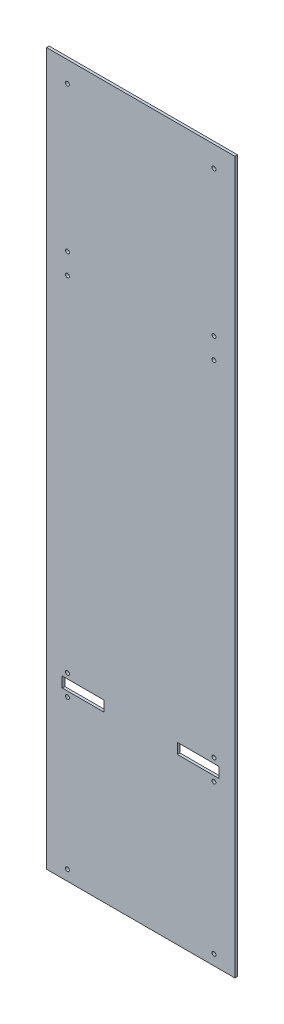
ISO-10303-21;
HEADER;
FILE_DESCRIPTION(('STEP AP214'),'2;1');
FILE_NAME('part.step','',(''),(''),'','','');
FILE_SCHEMA(('AUTOMOTIVE_DESIGN { 1 0 10303 214 1 1 1 1 }'));
ENDSEC;
DATA;
#1=APPLICATION_CONTEXT('core data for automotive mechanical design processes');
#2=APPLICATION_PROTOCOL_DEFINITION('international standard','automotive_design',2000,#1);
#3=PRODUCT_CONTEXT('',#1,'mechanical');
#4=PRODUCT('Part','Part','',(#3));
#5=PRODUCT_RELATED_PRODUCT_CATEGORY('part','',(#4));
#6=PRODUCT_DEFINITION_FORMATION('','',#4);
#7=PRODUCT_DEFINITION_CONTEXT('part definition',#1,'design');
#8=PRODUCT_DEFINITION('design','',#6,#7);
#9=PRODUCT_DEFINITION_SHAPE('','',#8);
#10=(LENGTH_UNIT() NAMED_UNIT(*) SI_UNIT(.MILLI.,.METRE.));
#11=(NAMED_UNIT(*) PLANE_ANGLE_UNIT() SI_UNIT($,.RADIAN.));
#12=(NAMED_UNIT(*) SI_UNIT($,.STERADIAN.) SOLID_ANGLE_UNIT());
#13=UNCERTAINTY_MEASURE_WITH_UNIT(LENGTH_MEASURE(1.E-05),#10,'distance_accuracy_value','');
#14=(GEOMETRIC_REPRESENTATION_CONTEXT(3) GLOBAL_UNCERTAINTY_ASSIGNED_CONTEXT((#13)) GLOBAL_UNIT_ASSIGNED_CONTEXT((#10,
#11,#12)) REPRESENTATION_CONTEXT('',''));
#15=CARTESIAN_POINT('',(0.,0.,0.));
#16=DIRECTION('',(0.,0.,1.));
#17=DIRECTION('',(1.,0.,0.));
#18=AXIS2_PLACEMENT_3D('',#15,#16,#17);
#19=CARTESIAN_POINT('',(0.,0.,6.35));
#20=DIRECTION('',(0.,0.,1.));
#21=DIRECTION('',(1.,0.,0.));
#22=AXIS2_PLACEMENT_3D('',#19,#20,#21);
#23=PLANE('',#22);
#24=CARTESIAN_POINT('',(-177.8,812.8,6.35));
#25=DIRECTION('',(0.,0.,1.));
#26=DIRECTION('',(1.,0.,0.));
#27=AXIS2_PLACEMENT_3D('',#24,#25,#26);
#28=CIRCLE('',#27,4.7625);
#29=CARTESIAN_POINT('',(-173.0375,812.8,6.35));
#30=VERTEX_POINT('',#29);
#31=EDGE_CURVE('E166',#30,#30,#28,.F.);
#32=ORIENTED_EDGE('',*,*,#31,.T.);
#33=EDGE_LOOP('',(#32));
#34=FACE_BOUND('',#33,.T.);
#35=CARTESIAN_POINT('',(-177.8,460.375,6.35));
#36=DIRECTION('',(0.,0.,1.));
#37=DIRECTION('',(1.,0.,0.));
#38=AXIS2_PLACEMENT_3D('',#35,#36,#37);
#39=CIRCLE('',#38,4.7625);
#40=CARTESIAN_POINT('',(-173.0375,460.375,6.35));
#41=VERTEX_POINT('',#40);
#42=EDGE_CURVE('E169',#41,#41,#39,.F.);
#43=ORIENTED_EDGE('',*,*,#42,.T.);
#44=EDGE_LOOP('',(#43));
#45=FACE_BOUND('',#44,.T.);
#46=CARTESIAN_POINT('',(-177.8,409.575,6.35));
#47=DIRECTION('',(0.,0.,1.));
#48=DIRECTION('',(1.,0.,0.));
#49=AXIS2_PLACEMENT_3D('',#46,#47,#48);
#50=CIRCLE('',#49,4.7625);
#51=CARTESIAN_POINT('',(-173.0375,409.575,6.35));
#52=VERTEX_POINT('',#51);
#53=EDGE_CURVE('E172',#52,#52,#50,.F.);
#54=ORIENTED_EDGE('',*,*,#53,.T.);
#55=EDGE_LOOP('',(#54));
#56=FACE_BOUND('',#55,.T.);
#57=CARTESIAN_POINT('',(-177.8,-425.45,6.35));
#58=DIRECTION('',(0.,0.,1.));
#59=DIRECTION('',(1.,0.,0.));
#60=AXIS2_PLACEMENT_3D('',#57,#58,#59);
#61=CIRCLE('',#60,4.7625);
#62=CARTESIAN_POINT('',(-173.0375,-425.45,6.35));
#63=VERTEX_POINT('',#62);
#64=EDGE_CURVE('E175',#63,#63,#61,.F.);
#65=ORIENTED_EDGE('',*,*,#64,.T.);
#66=EDGE_LOOP('',(#65));
#67=FACE_BOUND('',#66,.T.);
#68=CARTESIAN_POINT('',(-177.8,-476.25,6.35));
#69=DIRECTION('',(0.,0.,1.));
#70=DIRECTION('',(1.,0.,0.));
#71=AXIS2_PLACEMENT_3D('',#68,#69,#70);
#72=CIRCLE('',#71,4.7625);
#73=CARTESIAN_POINT('',(-173.0375,-476.25,6.35));
#74=VERTEX_POINT('',#73);
#75=EDGE_CURVE('E178',#74,#74,#72,.F.);
#76=ORIENTED_EDGE('',*,*,#75,.T.);
#77=EDGE_LOOP('',(#76));
#78=FACE_BOUND('',#77,.T.);
#79=CARTESIAN_POINT('',(-177.8,-838.2,6.35));
#80=DIRECTION('',(0.,0.,1.));
#81=DIRECTION('',(1.,0.,0.));
#82=AXIS2_PLACEMENT_3D('',#79,#80,#81);
#83=CIRCLE('',#82,4.7625);
#84=CARTESIAN_POINT('',(-173.0375,-838.2,6.35));
#85=VERTEX_POINT('',#84);
#86=EDGE_CURVE('E181',#85,#85,#83,.F.);
#87=ORIENTED_EDGE('',*,*,#86,.T.);
#88=EDGE_LOOP('',(#87));
#89=FACE_BOUND('',#88,.T.);
#90=CARTESIAN_POINT('',(177.8,812.8,6.35));
#91=DIRECTION('',(0.,0.,-1.));
#92=DIRECTION('',(-1.,0.,0.));
#93=AXIS2_PLACEMENT_3D('',#90,#91,#92);
#94=CIRCLE('',#93,4.7625);
#95=CARTESIAN_POINT('',(173.0375,812.8,6.35));
#96=VERTEX_POINT('',#95);
#97=EDGE_CURVE('E184',#96,#96,#94,.T.);
#98=ORIENTED_EDGE('',*,*,#97,.T.);
#99=EDGE_LOOP('',(#98));
#100=FACE_BOUND('',#99,.T.);
#101=CARTESIAN_POINT('',(177.8,460.375,6.35));
#102=DIRECTION('',(0.,0.,-1.));
#103=DIRECTION('',(-1.,0.,0.));
#104=AXIS2_PLACEMENT_3D('',#101,#102,#103);
#105=CIRCLE('',#104,4.7625);
#106=CARTESIAN_POINT('',(173.0375,460.375,6.35));
#107=VERTEX_POINT('',#106);
#108=EDGE_CURVE('E187',#107,#107,#105,.T.);
#109=ORIENTED_EDGE('',*,*,#108,.T.);
#110=EDGE_LOOP('',(#109));
#111=FACE_BOUND('',#110,.T.);
#112=CARTESIAN_POINT('',(177.8,409.575,6.35));
#113=DIRECTION('',(0.,0.,-1.));
#114=DIRECTION('',(-1.,0.,0.));
#115=AXIS2_PLACEMENT_3D('',#112,#113,#114);
#116=CIRCLE('',#115,4.7625);
#117=CARTESIAN_POINT('',(173.0375,409.575,6.35));
#118=VERTEX_POINT('',#117);
#119=EDGE_CURVE('E190',#118,#118,#116,.T.);
#120=ORIENTED_EDGE('',*,*,#119,.T.);
#121=EDGE_LOOP('',(#120));
#122=FACE_BOUND('',#121,.T.);
#123=CARTESIAN_POINT('',(177.8,-425.45,6.35));
#124=DIRECTION('',(0.,0.,-1.));
#125=DIRECTION('',(-1.,0.,0.));
#126=AXIS2_PLACEMENT_3D('',#123,#124,#125);
#127=CIRCLE('',#126,4.7625);
#128=CARTESIAN_POINT('',(173.0375,-425.45,6.35));
#129=VERTEX_POINT('',#128);
#130=EDGE_CURVE('E193',#129,#129,#127,.T.);
#131=ORIENTED_EDGE('',*,*,#130,.T.);
#132=EDGE_LOOP('',(#131));
#133=FACE_BOUND('',#132,.T.);
#134=CARTESIAN_POINT('',(177.8,-476.25,6.35));
#135=DIRECTION('',(0.,0.,-1.));
#136=DIRECTION('',(-1.,0.,0.));
#137=AXIS2_PLACEMENT_3D('',#134,#135,#136);
#138=CIRCLE('',#137,4.7625);
#139=CARTESIAN_POINT('',(173.0375,-476.25,6.35));
#140=VERTEX_POINT('',#139);
#141=EDGE_CURVE('E195',#140,#140,#138,.T.);
#142=ORIENTED_EDGE('',*,*,#141,.T.);
#143=EDGE_LOOP('',(#142));
#144=FACE_BOUND('',#143,.T.);
#145=CARTESIAN_POINT('',(177.8,-838.2,6.35));
#146=DIRECTION('',(0.,0.,-1.));
#147=DIRECTION('',(-1.,0.,0.));
#148=AXIS2_PLACEMENT_3D('',#145,#146,#147);
#149=CIRCLE('',#148,4.7625);
#150=CARTESIAN_POINT('',(173.0375,-838.2,6.35));
#151=VERTEX_POINT('',#150);
#152=EDGE_CURVE('E20',#151,#151,#149,.T.);
#153=ORIENTED_EDGE('',*,*,#152,.T.);
#154=EDGE_LOOP('',(#153));
#155=FACE_BOUND('',#154,.T.);
#156=DIRECTION('',(0.,1.,0.));
#157=VECTOR('',#156,1.);
#158=CARTESIAN_POINT('',(-88.9,-438.15,6.35));
#159=LINE('',#158,#157);
#160=CARTESIAN_POINT('',(-88.9,-463.55,6.35));
#161=VERTEX_POINT('',#160);
#162=CARTESIAN_POINT('',(-88.9,-438.15,6.35));
#163=VERTEX_POINT('',#162);
#164=EDGE_CURVE('E243',#161,#163,#159,.T.);
#165=ORIENTED_EDGE('',*,*,#164,.F.);
#166=DIRECTION('',(1.,0.,0.));
#167=VECTOR('',#166,1.);
#168=CARTESIAN_POINT('',(-190.5,-463.55,6.35));
#169=LINE('',#168,#167);
#170=CARTESIAN_POINT('',(-190.5,-463.55,6.35));
#171=VERTEX_POINT('',#170);
#172=EDGE_CURVE('E236',#161,#171,#169,.F.);
#173=ORIENTED_EDGE('',*,*,#172,.T.);
#174=DIRECTION('',(0.,1.,0.));
#175=VECTOR('',#174,1.);
#176=CARTESIAN_POINT('',(-190.5,-438.15,6.35));
#177=LINE('',#176,#175);
#178=CARTESIAN_POINT('',(-190.5,-438.15,6.35));
#179=VERTEX_POINT('',#178);
#180=EDGE_CURVE('E230',#171,#179,#177,.T.);
#181=ORIENTED_EDGE('',*,*,#180,.T.);
#182=DIRECTION('',(1.,0.,0.));
#183=VECTOR('',#182,1.);
#184=CARTESIAN_POINT('',(190.5,-438.15,6.35));
#185=LINE('',#184,#183);
#186=EDGE_CURVE('E245',#179,#163,#185,.T.);
#187=ORIENTED_EDGE('',*,*,#186,.T.);
#188=EDGE_LOOP('',(#165,#173,#181,#187));
#189=FACE_BOUND('',#188,.T.);
#190=DIRECTION('',(0.,1.,0.));
#191=VECTOR('',#190,1.);
#192=CARTESIAN_POINT('',(88.9,-463.55,6.35));
#193=LINE('',#192,#191);
#194=CARTESIAN_POINT('',(88.9,-438.15,6.35));
#195=VERTEX_POINT('',#194);
#196=CARTESIAN_POINT('',(88.9,-463.55,6.35));
#197=VERTEX_POINT('',#196);
#198=EDGE_CURVE('E222',#195,#197,#193,.F.);
#199=ORIENTED_EDGE('',*,*,#198,.F.);
#200=DIRECTION('',(1.,0.,0.));
#201=VECTOR('',#200,1.);
#202=CARTESIAN_POINT('',(190.5,-438.15,6.35));
#203=LINE('',#202,#201);
#204=CARTESIAN_POINT('',(190.5,-438.15,6.35));
#205=VERTEX_POINT('',#204);
#206=EDGE_CURVE('E215',#195,#205,#203,.T.);
#207=ORIENTED_EDGE('',*,*,#206,.T.);
#208=DIRECTION('',(0.,1.,0.));
#209=VECTOR('',#208,1.);
#210=CARTESIAN_POINT('',(190.5,-463.55,6.35));
#211=LINE('',#210,#209);
#212=CARTESIAN_POINT('',(190.5,-463.55,6.35));
#213=VERTEX_POINT('',#212);
#214=EDGE_CURVE('E204',#205,#213,#211,.F.);
#215=ORIENTED_EDGE('',*,*,#214,.T.);
#216=DIRECTION('',(1.,0.,0.));
#217=VECTOR('',#216,1.);
#218=CARTESIAN_POINT('',(-190.5,-463.55,6.35));
#219=LINE('',#218,#217);
#220=EDGE_CURVE('E224',#213,#197,#219,.F.);
#221=ORIENTED_EDGE('',*,*,#220,.T.);
#222=EDGE_LOOP('',(#199,#207,#215,#221));
#223=FACE_BOUND('',#222,.T.);
#224=DIRECTION('',(1.,0.,0.));
#225=VECTOR('',#224,1.);
#226=CARTESIAN_POINT('',(228.6,863.6,6.35));
#227=LINE('',#226,#225);
#228=CARTESIAN_POINT('',(-228.6,863.6,6.35));
#229=VERTEX_POINT('',#228);
#230=CARTESIAN_POINT('',(228.6,863.6,6.35));
#231=VERTEX_POINT('',#230);
#232=EDGE_CURVE('E121',#229,#231,#227,.T.);
#233=ORIENTED_EDGE('',*,*,#232,.F.);
#234=DIRECTION('',(0.,1.,0.));
#235=VECTOR('',#234,1.);
#236=CARTESIAN_POINT('',(-228.6,863.6,6.35));
#237=LINE('',#236,#235);
#238=CARTESIAN_POINT('',(-228.6,-863.6,6.35));
#239=VERTEX_POINT('',#238);
#240=EDGE_CURVE('E118',#239,#229,#237,.T.);
#241=ORIENTED_EDGE('',*,*,#240,.F.);
#242=DIRECTION('',(1.,0.,0.));
#243=VECTOR('',#242,1.);
#244=CARTESIAN_POINT('',(-228.6,-863.6,6.35));
#245=LINE('',#244,#243);
#246=CARTESIAN_POINT('',(228.6,-863.6,6.35));
#247=VERTEX_POINT('',#246);
#248=EDGE_CURVE('E109',#247,#239,#245,.F.);
#249=ORIENTED_EDGE('',*,*,#248,.F.);
#250=DIRECTION('',(0.,1.,0.));
#251=VECTOR('',#250,1.);
#252=CARTESIAN_POINT('',(228.6,-863.6,6.35));
#253=LINE('',#252,#251);
#254=EDGE_CURVE('E104',#231,#247,#253,.F.);
#255=ORIENTED_EDGE('',*,*,#254,.F.);
#256=EDGE_LOOP('',(#233,#241,#249,#255));
#257=FACE_BOUND('',#256,.T.);
#258=ADVANCED_FACE('F17',(#34,#45,#56,#67,#78,#89,#100,#111,#122,#133,#144,#155,#189,#223,#257),
#23,.T.);
#259=CARTESIAN_POINT('',(-228.6,863.6,0.));
#260=DIRECTION('',(-1.,0.,0.));
#261=DIRECTION('',(0.,0.,1.));
#262=AXIS2_PLACEMENT_3D('',#259,#260,#261);
#263=PLANE('',#262);
#264=DIRECTION('',(0.,0.,1.));
#265=VECTOR('',#264,1.);
#266=CARTESIAN_POINT('',(-228.6,863.6,0.));
#267=LINE('',#266,#265);
#268=CARTESIAN_POINT('',(-228.6,863.6,0.));
#269=VERTEX_POINT('',#268);
#270=EDGE_CURVE('E251',#269,#229,#267,.T.);
#271=ORIENTED_EDGE('',*,*,#270,.F.);
#272=DIRECTION('',(0.,1.,0.));
#273=VECTOR('',#272,1.);
#274=CARTESIAN_POINT('',(-228.6,0.,0.));
#275=LINE('',#274,#273);
#276=CARTESIAN_POINT('',(-228.6,-863.6,0.));
#277=VERTEX_POINT('',#276);
#278=EDGE_CURVE('E128',#269,#277,#275,.F.);
#279=ORIENTED_EDGE('',*,*,#278,.T.);
#280=DIRECTION('',(0.,0.,-1.));
#281=VECTOR('',#280,1.);
#282=CARTESIAN_POINT('',(-228.6,-863.6,0.));
#283=LINE('',#282,#281);
#284=EDGE_CURVE('E114',#239,#277,#283,.T.);
#285=ORIENTED_EDGE('',*,*,#284,.F.);
#286=ORIENTED_EDGE('',*,*,#240,.T.);
#287=EDGE_LOOP('',(#271,#279,#285,#286));
#288=FACE_BOUND('',#287,.T.);
#289=ADVANCED_FACE('F127',(#288),#263,.T.);
#290=CARTESIAN_POINT('',(-228.6,-863.6,0.));
#291=DIRECTION('',(0.,-1.,0.));
#292=DIRECTION('',(0.,0.,-1.));
#293=AXIS2_PLACEMENT_3D('',#290,#291,#292);
#294=PLANE('',#293);
#295=ORIENTED_EDGE('',*,*,#284,.T.);
#296=DIRECTION('',(1.,0.,0.));
#297=VECTOR('',#296,1.);
#298=CARTESIAN_POINT('',(0.,-863.6,0.));
#299=LINE('',#298,#297);
#300=CARTESIAN_POINT('',(228.6,-863.6,0.));
#301=VERTEX_POINT('',#300);
#302=EDGE_CURVE('E259',#277,#301,#299,.T.);
#303=ORIENTED_EDGE('',*,*,#302,.T.);
#304=DIRECTION('',(0.,0.,-1.));
#305=VECTOR('',#304,1.);
#306=CARTESIAN_POINT('',(228.6,-863.6,0.));
#307=LINE('',#306,#305);
#308=EDGE_CURVE('E116',#247,#301,#307,.T.);
#309=ORIENTED_EDGE('',*,*,#308,.F.);
#310=ORIENTED_EDGE('',*,*,#248,.T.);
#311=EDGE_LOOP('',(#295,#303,#309,#310));
#312=FACE_BOUND('',#311,.T.);
#313=ADVANCED_FACE('F111',(#312),#294,.T.);
#314=CARTESIAN_POINT('',(228.6,-863.6,0.));
#315=DIRECTION('',(1.,0.,0.));
#316=DIRECTION('',(0.,0.,-1.));
#317=AXIS2_PLACEMENT_3D('',#314,#315,#316);
#318=PLANE('',#317);
#319=ORIENTED_EDGE('',*,*,#308,.T.);
#320=DIRECTION('',(0.,1.,0.));
#321=VECTOR('',#320,1.);
#322=CARTESIAN_POINT('',(228.6,0.,0.));
#323=LINE('',#322,#321);
#324=CARTESIAN_POINT('',(228.6,863.6,0.));
#325=VERTEX_POINT('',#324);
#326=EDGE_CURVE('E255',#301,#325,#323,.T.);
#327=ORIENTED_EDGE('',*,*,#326,.T.);
#328=DIRECTION('',(0.,0.,1.));
#329=VECTOR('',#328,1.);
#330=CARTESIAN_POINT('',(228.6,863.6,0.));
#331=LINE('',#330,#329);
#332=EDGE_CURVE('E248',#231,#325,#331,.F.);
#333=ORIENTED_EDGE('',*,*,#332,.F.);
#334=ORIENTED_EDGE('',*,*,#254,.T.);
#335=EDGE_LOOP('',(#319,#327,#333,#334));
#336=FACE_BOUND('',#335,.T.);
#337=ADVANCED_FACE('F254',(#336),#318,.T.);
#338=CARTESIAN_POINT('',(228.6,863.6,0.));
#339=DIRECTION('',(0.,1.,0.));
#340=DIRECTION('',(0.,0.,1.));
#341=AXIS2_PLACEMENT_3D('',#338,#339,#340);
#342=PLANE('',#341);
#343=ORIENTED_EDGE('',*,*,#332,.T.);
#344=DIRECTION('',(1.,0.,0.));
#345=VECTOR('',#344,1.);
#346=CARTESIAN_POINT('',(0.,863.6,0.));
#347=LINE('',#346,#345);
#348=EDGE_CURVE('E261',#325,#269,#347,.F.);
#349=ORIENTED_EDGE('',*,*,#348,.T.);
#350=ORIENTED_EDGE('',*,*,#270,.T.);
#351=ORIENTED_EDGE('',*,*,#232,.T.);
#352=EDGE_LOOP('',(#343,#349,#350,#351));
#353=FACE_BOUND('',#352,.T.);
#354=ADVANCED_FACE('F384',(#353),#342,.T.);
#355=CARTESIAN_POINT('',(190.5,-438.15,6.35));
#356=DIRECTION('',(0.,1.,0.));
#357=DIRECTION('',(0.,0.,1.));
#358=AXIS2_PLACEMENT_3D('',#355,#356,#357);
#359=PLANE('',#358);
#360=DIRECTION('',(0.,0.,1.));
#361=VECTOR('',#360,1.);
#362=CARTESIAN_POINT('',(-190.5,-438.15,6.35));
#363=LINE('',#362,#361);
#364=CARTESIAN_POINT('',(-190.5,-438.15,0.));
#365=VERTEX_POINT('',#364);
#366=EDGE_CURVE('E227',#179,#365,#363,.F.);
#367=ORIENTED_EDGE('',*,*,#366,.T.);
#368=DIRECTION('',(1.,0.,0.));
#369=VECTOR('',#368,1.);
#370=CARTESIAN_POINT('',(0.,-438.15,0.));
#371=LINE('',#370,#369);
#372=CARTESIAN_POINT('',(-88.9,-438.15,0.));
#373=VERTEX_POINT('',#372);
#374=EDGE_CURVE('E265',#365,#373,#371,.T.);
#375=ORIENTED_EDGE('',*,*,#374,.T.);
#376=DIRECTION('',(0.,0.,1.));
#377=VECTOR('',#376,1.);
#378=CARTESIAN_POINT('',(-88.9,-438.15,6.35));
#379=LINE('',#378,#377);
#380=EDGE_CURVE('E241',#163,#373,#379,.F.);
#381=ORIENTED_EDGE('',*,*,#380,.F.);
#382=ORIENTED_EDGE('',*,*,#186,.F.);
#383=EDGE_LOOP('',(#367,#375,#381,#382));
#384=FACE_BOUND('',#383,.T.);
#385=ADVANCED_FACE('F380',(#384),#359,.F.);
#386=CARTESIAN_POINT('',(-88.9,-438.15,6.35));
#387=DIRECTION('',(-1.,0.,0.));
#388=DIRECTION('',(0.,0.,1.));
#389=AXIS2_PLACEMENT_3D('',#386,#387,#388);
#390=PLANE('',#389);
#391=DIRECTION('',(0.,1.,0.));
#392=VECTOR('',#391,1.);
#393=CARTESIAN_POINT('',(-88.9,0.,0.));
#394=LINE('',#393,#392);
#395=CARTESIAN_POINT('',(-88.9,-463.55,0.));
#396=VERTEX_POINT('',#395);
#397=EDGE_CURVE('E268',#373,#396,#394,.F.);
#398=ORIENTED_EDGE('',*,*,#397,.T.);
#399=DIRECTION('',(0.,0.,-1.));
#400=VECTOR('',#399,1.);
#401=CARTESIAN_POINT('',(-88.9,-463.55,6.35));
#402=LINE('',#401,#400);
#403=EDGE_CURVE('E238',#396,#161,#402,.F.);
#404=ORIENTED_EDGE('',*,*,#403,.T.);
#405=ORIENTED_EDGE('',*,*,#164,.T.);
#406=ORIENTED_EDGE('',*,*,#380,.T.);
#407=EDGE_LOOP('',(#398,#404,#405,#406));
#408=FACE_BOUND('',#407,.T.);
#409=ADVANCED_FACE('F376',(#408),#390,.T.);
#410=CARTESIAN_POINT('',(-190.5,-463.55,6.35));
#411=DIRECTION('',(0.,-1.,0.));
#412=DIRECTION('',(0.,0.,-1.));
#413=AXIS2_PLACEMENT_3D('',#410,#411,#412);
#414=PLANE('',#413);
#415=DIRECTION('',(0.,0.,1.));
#416=VECTOR('',#415,1.);
#417=CARTESIAN_POINT('',(-190.5,-463.55,6.35));
#418=LINE('',#417,#416);
#419=CARTESIAN_POINT('',(-190.5,-463.55,0.));
#420=VERTEX_POINT('',#419);
#421=EDGE_CURVE('E233',#420,#171,#418,.T.);
#422=ORIENTED_EDGE('',*,*,#421,.T.);
#423=ORIENTED_EDGE('',*,*,#172,.F.);
#424=ORIENTED_EDGE('',*,*,#403,.F.);
#425=DIRECTION('',(1.,0.,0.));
#426=VECTOR('',#425,1.);
#427=CARTESIAN_POINT('',(0.,-463.55,0.));
#428=LINE('',#427,#426);
#429=EDGE_CURVE('E271',#396,#420,#428,.F.);
#430=ORIENTED_EDGE('',*,*,#429,.T.);
#431=EDGE_LOOP('',(#422,#423,#424,#430));
#432=FACE_BOUND('',#431,.T.);
#433=ADVANCED_FACE('F372',(#432),#414,.F.);
#434=CARTESIAN_POINT('',(-190.5,-438.15,6.35));
#435=DIRECTION('',(-1.,0.,0.));
#436=DIRECTION('',(0.,0.,1.));
#437=AXIS2_PLACEMENT_3D('',#434,#435,#436);
#438=PLANE('',#437);
#439=ORIENTED_EDGE('',*,*,#180,.F.);
#440=ORIENTED_EDGE('',*,*,#421,.F.);
#441=DIRECTION('',(0.,1.,0.));
#442=VECTOR('',#441,1.);
#443=CARTESIAN_POINT('',(-190.5,0.,0.));
#444=LINE('',#443,#442);
#445=EDGE_CURVE('E274',#420,#365,#444,.T.);
#446=ORIENTED_EDGE('',*,*,#445,.T.);
#447=ORIENTED_EDGE('',*,*,#366,.F.);
#448=EDGE_LOOP('',(#439,#440,#446,#447));
#449=FACE_BOUND('',#448,.T.);
#450=ADVANCED_FACE('F369',(#449),#438,.F.);
#451=CARTESIAN_POINT('',(-190.5,-463.55,6.35));
#452=DIRECTION('',(0.,-1.,0.));
#453=DIRECTION('',(0.,0.,-1.));
#454=AXIS2_PLACEMENT_3D('',#451,#452,#453);
#455=PLANE('',#454);
#456=DIRECTION('',(0.,0.,-1.));
#457=VECTOR('',#456,1.);
#458=CARTESIAN_POINT('',(190.5,-463.55,6.35));
#459=LINE('',#458,#457);
#460=CARTESIAN_POINT('',(190.5,-463.55,0.));
#461=VERTEX_POINT('',#460);
#462=EDGE_CURVE('E200',#213,#461,#459,.T.);
#463=ORIENTED_EDGE('',*,*,#462,.T.);
#464=DIRECTION('',(1.,0.,0.));
#465=VECTOR('',#464,1.);
#466=CARTESIAN_POINT('',(0.,-463.55,0.));
#467=LINE('',#466,#465);
#468=CARTESIAN_POINT('',(88.9,-463.55,0.));
#469=VERTEX_POINT('',#468);
#470=EDGE_CURVE('E277',#461,#469,#467,.F.);
#471=ORIENTED_EDGE('',*,*,#470,.T.);
#472=DIRECTION('',(0.,0.,-1.));
#473=VECTOR('',#472,1.);
#474=CARTESIAN_POINT('',(88.9,-463.55,6.35));
#475=LINE('',#474,#473);
#476=EDGE_CURVE('E220',#197,#469,#475,.T.);
#477=ORIENTED_EDGE('',*,*,#476,.F.);
#478=ORIENTED_EDGE('',*,*,#220,.F.);
#479=EDGE_LOOP('',(#463,#471,#477,#478));
#480=FACE_BOUND('',#479,.T.);
#481=ADVANCED_FACE('F296',(#480),#455,.F.);
#482=CARTESIAN_POINT('',(88.9,-463.55,6.35));
#483=DIRECTION('',(1.,0.,0.));
#484=DIRECTION('',(0.,0.,-1.));
#485=AXIS2_PLACEMENT_3D('',#482,#483,#484);
#486=PLANE('',#485);
#487=ORIENTED_EDGE('',*,*,#198,.T.);
#488=ORIENTED_EDGE('',*,*,#476,.T.);
#489=DIRECTION('',(0.,1.,0.));
#490=VECTOR('',#489,1.);
#491=CARTESIAN_POINT('',(88.9,0.,0.));
#492=LINE('',#491,#490);
#493=CARTESIAN_POINT('',(88.9,-438.15,0.));
#494=VERTEX_POINT('',#493);
#495=EDGE_CURVE('E279',#469,#494,#492,.T.);
#496=ORIENTED_EDGE('',*,*,#495,.T.);
#497=DIRECTION('',(0.,0.,1.));
#498=VECTOR('',#497,1.);
#499=CARTESIAN_POINT('',(88.9,-438.15,6.35));
#500=LINE('',#499,#498);
#501=EDGE_CURVE('E217',#494,#195,#500,.T.);
#502=ORIENTED_EDGE('',*,*,#501,.T.);
#503=EDGE_LOOP('',(#487,#488,#496,#502));
#504=FACE_BOUND('',#503,.T.);
#505=ADVANCED_FACE('F294',(#504),#486,.T.);
#506=CARTESIAN_POINT('',(190.5,-438.15,6.35));
#507=DIRECTION('',(0.,1.,0.));
#508=DIRECTION('',(0.,0.,1.));
#509=AXIS2_PLACEMENT_3D('',#506,#507,#508);
#510=PLANE('',#509);
#511=DIRECTION('',(0.,0.,-1.));
#512=VECTOR('',#511,1.);
#513=CARTESIAN_POINT('',(190.5,-438.15,6.35));
#514=LINE('',#513,#512);
#515=CARTESIAN_POINT('',(190.5,-438.15,0.));
#516=VERTEX_POINT('',#515);
#517=EDGE_CURVE('E35',#516,#205,#514,.F.);
#518=ORIENTED_EDGE('',*,*,#517,.T.);
#519=ORIENTED_EDGE('',*,*,#206,.F.);
#520=ORIENTED_EDGE('',*,*,#501,.F.);
#521=DIRECTION('',(1.,0.,0.));
#522=VECTOR('',#521,1.);
#523=CARTESIAN_POINT('',(0.,-438.15,0.));
#524=LINE('',#523,#522);
#525=EDGE_CURVE('E282',#494,#516,#524,.T.);
#526=ORIENTED_EDGE('',*,*,#525,.T.);
#527=EDGE_LOOP('',(#518,#519,#520,#526));
#528=FACE_BOUND('',#527,.T.);
#529=ADVANCED_FACE('F291',(#528),#510,.F.);
#530=CARTESIAN_POINT('',(190.5,-463.55,6.35));
#531=DIRECTION('',(1.,0.,0.));
#532=DIRECTION('',(0.,0.,-1.));
#533=AXIS2_PLACEMENT_3D('',#530,#531,#532);
#534=PLANE('',#533);
#535=ORIENTED_EDGE('',*,*,#214,.F.);
#536=ORIENTED_EDGE('',*,*,#517,.F.);
#537=DIRECTION('',(0.,1.,0.));
#538=VECTOR('',#537,1.);
#539=CARTESIAN_POINT('',(190.5,0.,0.));
#540=LINE('',#539,#538);
#541=EDGE_CURVE('E165',#516,#461,#540,.F.);
#542=ORIENTED_EDGE('',*,*,#541,.T.);
#543=ORIENTED_EDGE('',*,*,#462,.F.);
#544=EDGE_LOOP('',(#535,#536,#542,#543));
#545=FACE_BOUND('',#544,.T.);
#546=ADVANCED_FACE('F285',(#545),#534,.F.);
#547=CARTESIAN_POINT('',(177.8,-838.2,6.35));
#548=DIRECTION('',(0.,0.,-1.));
#549=DIRECTION('',(-1.,0.,0.));
#550=AXIS2_PLACEMENT_3D('',#547,#548,#549);
#551=CYLINDRICAL_SURFACE('',#550,4.7625);
#552=ORIENTED_EDGE('',*,*,#152,.F.);
#553=EDGE_LOOP('',(#552));
#554=FACE_BOUND('',#553,.T.);
#555=CARTESIAN_POINT('',(177.8,-838.2,0.));
#556=DIRECTION('',(0.,0.,-1.));
#557=DIRECTION('',(-1.,0.,0.));
#558=AXIS2_PLACEMENT_3D('',#555,#556,#557);
#559=CIRCLE('',#558,4.7625);
#560=CARTESIAN_POINT('',(173.0375,-838.2,0.));
#561=VERTEX_POINT('',#560);
#562=EDGE_CURVE('E162',#561,#561,#559,.T.);
#563=ORIENTED_EDGE('',*,*,#562,.T.);
#564=EDGE_LOOP('',(#563));
#565=FACE_BOUND('',#564,.T.);
#566=ADVANCED_FACE('F356',(#554,#565),#551,.F.);
#567=CARTESIAN_POINT('',(177.8,-476.25,6.35));
#568=DIRECTION('',(0.,0.,-1.));
#569=DIRECTION('',(-1.,0.,0.));
#570=AXIS2_PLACEMENT_3D('',#567,#568,#569);
#571=CYLINDRICAL_SURFACE('',#570,4.7625);
#572=ORIENTED_EDGE('',*,*,#141,.F.);
#573=EDGE_LOOP('',(#572));
#574=FACE_BOUND('',#573,.T.);
#575=CARTESIAN_POINT('',(177.8,-476.25,0.));
#576=DIRECTION('',(0.,0.,-1.));
#577=DIRECTION('',(-1.,0.,0.));
#578=AXIS2_PLACEMENT_3D('',#575,#576,#577);
#579=CIRCLE('',#578,4.7625);
#580=CARTESIAN_POINT('',(173.0375,-476.25,0.));
#581=VERTEX_POINT('',#580);
#582=EDGE_CURVE('E159',#581,#581,#579,.T.);
#583=ORIENTED_EDGE('',*,*,#582,.T.);
#584=EDGE_LOOP('',(#583));
#585=FACE_BOUND('',#584,.T.);
#586=ADVANCED_FACE('F352',(#574,#585),#571,.F.);
#587=CARTESIAN_POINT('',(177.8,-425.45,6.35));
#588=DIRECTION('',(0.,0.,-1.));
#589=DIRECTION('',(-1.,0.,0.));
#590=AXIS2_PLACEMENT_3D('',#587,#588,#589);
#591=CYLINDRICAL_SURFACE('',#590,4.7625);
#592=ORIENTED_EDGE('',*,*,#130,.F.);
#593=EDGE_LOOP('',(#592));
#594=FACE_BOUND('',#593,.T.);
#595=CARTESIAN_POINT('',(177.8,-425.45,0.));
#596=DIRECTION('',(0.,0.,-1.));
#597=DIRECTION('',(-1.,0.,0.));
#598=AXIS2_PLACEMENT_3D('',#595,#596,#597);
#599=CIRCLE('',#598,4.7625);
#600=CARTESIAN_POINT('',(173.0375,-425.45,0.));
#601=VERTEX_POINT('',#600);
#602=EDGE_CURVE('E156',#601,#601,#599,.T.);
#603=ORIENTED_EDGE('',*,*,#602,.T.);
#604=EDGE_LOOP('',(#603));
#605=FACE_BOUND('',#604,.T.);
#606=ADVANCED_FACE('F348',(#594,#605),#591,.F.);
#607=CARTESIAN_POINT('',(177.8,409.575,6.35));
#608=DIRECTION('',(0.,0.,-1.));
#609=DIRECTION('',(-1.,0.,0.));
#610=AXIS2_PLACEMENT_3D('',#607,#608,#609);
#611=CYLINDRICAL_SURFACE('',#610,4.7625);
#612=ORIENTED_EDGE('',*,*,#119,.F.);
#613=EDGE_LOOP('',(#612));
#614=FACE_BOUND('',#613,.T.);
#615=CARTESIAN_POINT('',(177.8,409.575,0.));
#616=DIRECTION('',(0.,0.,-1.));
#617=DIRECTION('',(-1.,0.,0.));
#618=AXIS2_PLACEMENT_3D('',#615,#616,#617);
#619=CIRCLE('',#618,4.7625);
#620=CARTESIAN_POINT('',(173.0375,409.575,0.));
#621=VERTEX_POINT('',#620);
#622=EDGE_CURVE('E153',#621,#621,#619,.T.);
#623=ORIENTED_EDGE('',*,*,#622,.T.);
#624=EDGE_LOOP('',(#623));
#625=FACE_BOUND('',#624,.T.);
#626=ADVANCED_FACE('F344',(#614,#625),#611,.F.);
#627=CARTESIAN_POINT('',(177.8,460.375,6.35));
#628=DIRECTION('',(0.,0.,-1.));
#629=DIRECTION('',(-1.,0.,0.));
#630=AXIS2_PLACEMENT_3D('',#627,#628,#629);
#631=CYLINDRICAL_SURFACE('',#630,4.7625);
#632=ORIENTED_EDGE('',*,*,#108,.F.);
#633=EDGE_LOOP('',(#632));
#634=FACE_BOUND('',#633,.T.);
#635=CARTESIAN_POINT('',(177.8,460.375,0.));
#636=DIRECTION('',(0.,0.,-1.));
#637=DIRECTION('',(-1.,0.,0.));
#638=AXIS2_PLACEMENT_3D('',#635,#636,#637);
#639=CIRCLE('',#638,4.7625);
#640=CARTESIAN_POINT('',(173.0375,460.375,0.));
#641=VERTEX_POINT('',#640);
#642=EDGE_CURVE('E150',#641,#641,#639,.T.);
#643=ORIENTED_EDGE('',*,*,#642,.T.);
#644=EDGE_LOOP('',(#643));
#645=FACE_BOUND('',#644,.T.);
#646=ADVANCED_FACE('F340',(#634,#645),#631,.F.);
#647=CARTESIAN_POINT('',(177.8,812.8,6.35));
#648=DIRECTION('',(0.,0.,-1.));
#649=DIRECTION('',(-1.,0.,0.));
#650=AXIS2_PLACEMENT_3D('',#647,#648,#649);
#651=CYLINDRICAL_SURFACE('',#650,4.7625);
#652=ORIENTED_EDGE('',*,*,#97,.F.);
#653=EDGE_LOOP('',(#652));
#654=FACE_BOUND('',#653,.T.);
#655=CARTESIAN_POINT('',(177.8,812.8,0.));
#656=DIRECTION('',(0.,0.,-1.));
#657=DIRECTION('',(-1.,0.,0.));
#658=AXIS2_PLACEMENT_3D('',#655,#656,#657);
#659=CIRCLE('',#658,4.7625);
#660=CARTESIAN_POINT('',(173.0375,812.8,0.));
#661=VERTEX_POINT('',#660);
#662=EDGE_CURVE('E147',#661,#661,#659,.T.);
#663=ORIENTED_EDGE('',*,*,#662,.T.);
#664=EDGE_LOOP('',(#663));
#665=FACE_BOUND('',#664,.T.);
#666=ADVANCED_FACE('F336',(#654,#665),#651,.F.);
#667=CARTESIAN_POINT('',(-177.8,-838.2,6.35));
#668=DIRECTION('',(0.,0.,1.));
#669=DIRECTION('',(1.,0.,0.));
#670=AXIS2_PLACEMENT_3D('',#667,#668,#669);
#671=CYLINDRICAL_SURFACE('',#670,4.7625);
#672=ORIENTED_EDGE('',*,*,#86,.F.);
#673=EDGE_LOOP('',(#672));
#674=FACE_BOUND('',#673,.T.);
#675=CARTESIAN_POINT('',(-177.8,-838.2,0.));
#676=DIRECTION('',(0.,0.,1.));
#677=DIRECTION('',(1.,0.,0.));
#678=AXIS2_PLACEMENT_3D('',#675,#676,#677);
#679=CIRCLE('',#678,4.7625);
#680=CARTESIAN_POINT('',(-173.0375,-838.2,0.));
#681=VERTEX_POINT('',#680);
#682=EDGE_CURVE('E144',#681,#681,#679,.F.);
#683=ORIENTED_EDGE('',*,*,#682,.T.);
#684=EDGE_LOOP('',(#683));
#685=FACE_BOUND('',#684,.T.);
#686=ADVANCED_FACE('F332',(#674,#685),#671,.F.);
#687=CARTESIAN_POINT('',(-177.8,-476.25,6.35));
#688=DIRECTION('',(0.,0.,1.));
#689=DIRECTION('',(1.,0.,0.));
#690=AXIS2_PLACEMENT_3D('',#687,#688,#689);
#691=CYLINDRICAL_SURFACE('',#690,4.7625);
#692=ORIENTED_EDGE('',*,*,#75,.F.);
#693=EDGE_LOOP('',(#692));
#694=FACE_BOUND('',#693,.T.);
#695=CARTESIAN_POINT('',(-177.8,-476.25,0.));
#696=DIRECTION('',(0.,0.,1.));
#697=DIRECTION('',(1.,0.,0.));
#698=AXIS2_PLACEMENT_3D('',#695,#696,#697);
#699=CIRCLE('',#698,4.7625);
#700=CARTESIAN_POINT('',(-173.0375,-476.25,0.));
#701=VERTEX_POINT('',#700);
#702=EDGE_CURVE('E141',#701,#701,#699,.F.);
#703=ORIENTED_EDGE('',*,*,#702,.T.);
#704=EDGE_LOOP('',(#703));
#705=FACE_BOUND('',#704,.T.);
#706=ADVANCED_FACE('F328',(#694,#705),#691,.F.);
#707=CARTESIAN_POINT('',(-177.8,-425.45,6.35));
#708=DIRECTION('',(0.,0.,1.));
#709=DIRECTION('',(1.,0.,0.));
#710=AXIS2_PLACEMENT_3D('',#707,#708,#709);
#711=CYLINDRICAL_SURFACE('',#710,4.7625);
#712=ORIENTED_EDGE('',*,*,#64,.F.);
#713=EDGE_LOOP('',(#712));
#714=FACE_BOUND('',#713,.T.);
#715=CARTESIAN_POINT('',(-177.8,-425.45,0.));
#716=DIRECTION('',(0.,0.,1.));
#717=DIRECTION('',(1.,0.,0.));
#718=AXIS2_PLACEMENT_3D('',#715,#716,#717);
#719=CIRCLE('',#718,4.7625);
#720=CARTESIAN_POINT('',(-173.0375,-425.45,0.));
#721=VERTEX_POINT('',#720);
#722=EDGE_CURVE('E138',#721,#721,#719,.F.);
#723=ORIENTED_EDGE('',*,*,#722,.T.);
#724=EDGE_LOOP('',(#723));
#725=FACE_BOUND('',#724,.T.);
#726=ADVANCED_FACE('F324',(#714,#725),#711,.F.);
#727=CARTESIAN_POINT('',(-177.8,409.575,6.35));
#728=DIRECTION('',(0.,0.,1.));
#729=DIRECTION('',(1.,0.,0.));
#730=AXIS2_PLACEMENT_3D('',#727,#728,#729);
#731=CYLINDRICAL_SURFACE('',#730,4.7625);
#732=ORIENTED_EDGE('',*,*,#53,.F.);
#733=EDGE_LOOP('',(#732));
#734=FACE_BOUND('',#733,.T.);
#735=CARTESIAN_POINT('',(-177.8,409.575,0.));
#736=DIRECTION('',(0.,0.,1.));
#737=DIRECTION('',(1.,0.,0.));
#738=AXIS2_PLACEMENT_3D('',#735,#736,#737);
#739=CIRCLE('',#738,4.7625);
#740=CARTESIAN_POINT('',(-173.0375,409.575,0.));
#741=VERTEX_POINT('',#740);
#742=EDGE_CURVE('E135',#741,#741,#739,.F.);
#743=ORIENTED_EDGE('',*,*,#742,.T.);
#744=EDGE_LOOP('',(#743));
#745=FACE_BOUND('',#744,.T.);
#746=ADVANCED_FACE('F320',(#734,#745),#731,.F.);
#747=CARTESIAN_POINT('',(-177.8,460.375,6.35));
#748=DIRECTION('',(0.,0.,1.));
#749=DIRECTION('',(1.,0.,0.));
#750=AXIS2_PLACEMENT_3D('',#747,#748,#749);
#751=CYLINDRICAL_SURFACE('',#750,4.7625);
#752=ORIENTED_EDGE('',*,*,#42,.F.);
#753=EDGE_LOOP('',(#752));
#754=FACE_BOUND('',#753,.T.);
#755=CARTESIAN_POINT('',(-177.8,460.375,0.));
#756=DIRECTION('',(0.,0.,1.));
#757=DIRECTION('',(1.,0.,0.));
#758=AXIS2_PLACEMENT_3D('',#755,#756,#757);
#759=CIRCLE('',#758,4.7625);
#760=CARTESIAN_POINT('',(-173.0375,460.375,0.));
#761=VERTEX_POINT('',#760);
#762=EDGE_CURVE('E26',#761,#761,#759,.F.);
#763=ORIENTED_EDGE('',*,*,#762,.T.);
#764=EDGE_LOOP('',(#763));
#765=FACE_BOUND('',#764,.T.);
#766=ADVANCED_FACE('F312',(#754,#765),#751,.F.);
#767=CARTESIAN_POINT('',(-177.8,812.8,6.35));
#768=DIRECTION('',(0.,0.,1.));
#769=DIRECTION('',(1.,0.,0.));
#770=AXIS2_PLACEMENT_3D('',#767,#768,#769);
#771=CYLINDRICAL_SURFACE('',#770,4.7625);
#772=ORIENTED_EDGE('',*,*,#31,.F.);
#773=EDGE_LOOP('',(#772));
#774=FACE_BOUND('',#773,.T.);
#775=CARTESIAN_POINT('',(-177.8,812.8,0.));
#776=DIRECTION('',(0.,0.,1.));
#777=DIRECTION('',(1.,0.,0.));
#778=AXIS2_PLACEMENT_3D('',#775,#776,#777);
#779=CIRCLE('',#778,4.7625);
#780=CARTESIAN_POINT('',(-173.0375,812.8,0.));
#781=VERTEX_POINT('',#780);
#782=EDGE_CURVE('E11',#781,#781,#779,.F.);
#783=ORIENTED_EDGE('',*,*,#782,.T.);
#784=EDGE_LOOP('',(#783));
#785=FACE_BOUND('',#784,.T.);
#786=ADVANCED_FACE('F306',(#774,#785),#771,.F.);
#787=CARTESIAN_POINT('',(0.,0.,0.));
#788=DIRECTION('',(0.,0.,1.));
#789=DIRECTION('',(1.,0.,0.));
#790=AXIS2_PLACEMENT_3D('',#787,#788,#789);
#791=PLANE('',#790);
#792=ORIENTED_EDGE('',*,*,#782,.F.);
#793=EDGE_LOOP('',(#792));
#794=FACE_BOUND('',#793,.T.);
#795=ORIENTED_EDGE('',*,*,#762,.F.);
#796=EDGE_LOOP('',(#795));
#797=FACE_BOUND('',#796,.T.);
#798=ORIENTED_EDGE('',*,*,#742,.F.);
#799=EDGE_LOOP('',(#798));
#800=FACE_BOUND('',#799,.T.);
#801=ORIENTED_EDGE('',*,*,#722,.F.);
#802=EDGE_LOOP('',(#801));
#803=FACE_BOUND('',#802,.T.);
#804=ORIENTED_EDGE('',*,*,#702,.F.);
#805=EDGE_LOOP('',(#804));
#806=FACE_BOUND('',#805,.T.);
#807=ORIENTED_EDGE('',*,*,#682,.F.);
#808=EDGE_LOOP('',(#807));
#809=FACE_BOUND('',#808,.T.);
#810=ORIENTED_EDGE('',*,*,#662,.F.);
#811=EDGE_LOOP('',(#810));
#812=FACE_BOUND('',#811,.T.);
#813=ORIENTED_EDGE('',*,*,#642,.F.);
#814=EDGE_LOOP('',(#813));
#815=FACE_BOUND('',#814,.T.);
#816=ORIENTED_EDGE('',*,*,#622,.F.);
#817=EDGE_LOOP('',(#816));
#818=FACE_BOUND('',#817,.T.);
#819=ORIENTED_EDGE('',*,*,#602,.F.);
#820=EDGE_LOOP('',(#819));
#821=FACE_BOUND('',#820,.T.);
#822=ORIENTED_EDGE('',*,*,#582,.F.);
#823=EDGE_LOOP('',(#822));
#824=FACE_BOUND('',#823,.T.);
#825=ORIENTED_EDGE('',*,*,#562,.F.);
#826=EDGE_LOOP('',(#825));
#827=FACE_BOUND('',#826,.T.);
#828=ORIENTED_EDGE('',*,*,#525,.F.);
#829=ORIENTED_EDGE('',*,*,#495,.F.);
#830=ORIENTED_EDGE('',*,*,#470,.F.);
#831=ORIENTED_EDGE('',*,*,#541,.F.);
#832=EDGE_LOOP('',(#828,#829,#830,#831));
#833=FACE_BOUND('',#832,.T.);
#834=ORIENTED_EDGE('',*,*,#429,.F.);
#835=ORIENTED_EDGE('',*,*,#397,.F.);
#836=ORIENTED_EDGE('',*,*,#374,.F.);
#837=ORIENTED_EDGE('',*,*,#445,.F.);
#838=EDGE_LOOP('',(#834,#835,#836,#837));
#839=FACE_BOUND('',#838,.T.);
#840=ORIENTED_EDGE('',*,*,#326,.F.);
#841=ORIENTED_EDGE('',*,*,#302,.F.);
#842=ORIENTED_EDGE('',*,*,#278,.F.);
#843=ORIENTED_EDGE('',*,*,#348,.F.);
#844=EDGE_LOOP('',(#840,#841,#842,#843));
#845=FACE_BOUND('',#844,.T.);
#846=ADVANCED_FACE('F258',(#794,#797,#800,#803,#806,#809,#812,#815,#818,#821,#824,#827,#833,
#839,#845),#791,.F.);
#847=CLOSED_SHELL('',(#258,#289,#313,#337,#354,#385,#409,#433,#450,#481,#505,#529,#546,#566,
#586,#606,#626,#646,#666,#686,#706,#726,#746,#766,#786,#846));
#848=MANIFOLD_SOLID_BREP('B1',#847);
#849=ADVANCED_BREP_SHAPE_REPRESENTATION('',(#18,#848),#14);
#850=SHAPE_DEFINITION_REPRESENTATION(#9,#849);
ENDSEC;
END-ISO-10303-21;
